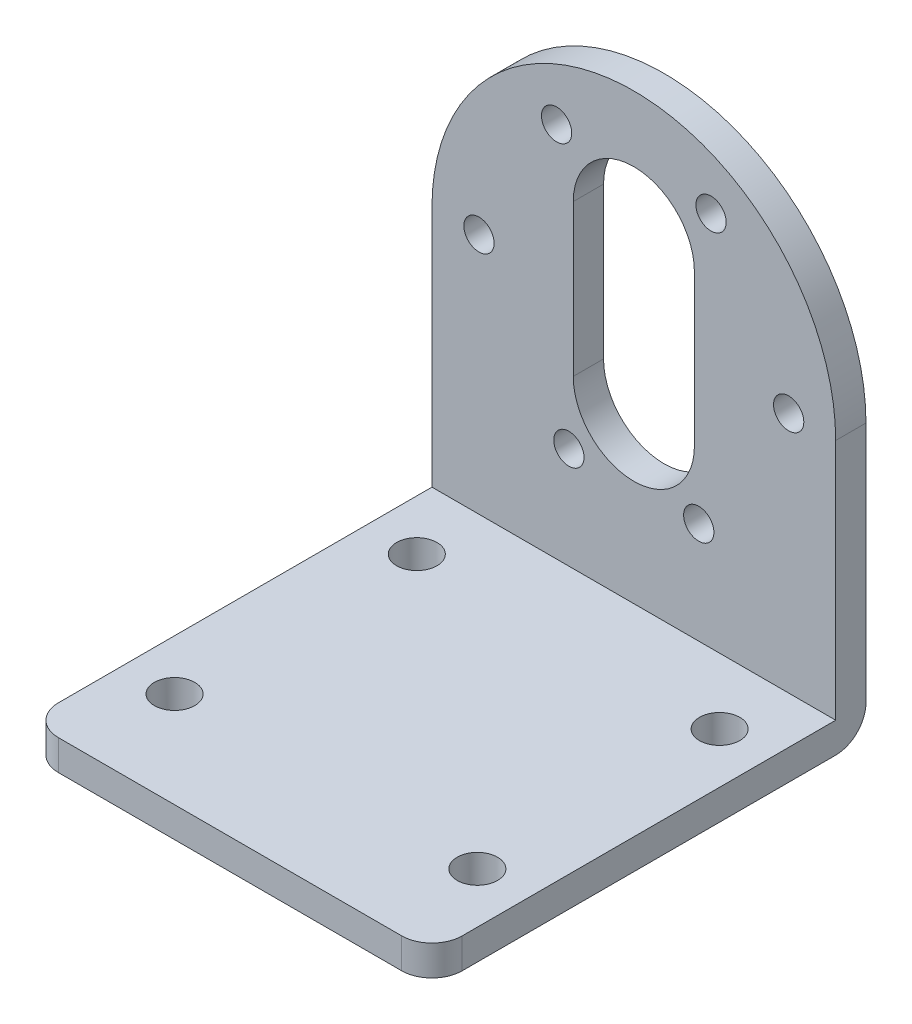
ISO-10303-21;
HEADER;
FILE_DESCRIPTION(('STEP AP214'),'2;1');
FILE_NAME('part.step','',(''),(''),'','','');
FILE_SCHEMA(('AUTOMOTIVE_DESIGN { 1 0 10303 214 1 1 1 1 }'));
ENDSEC;
DATA;
#1=APPLICATION_CONTEXT('core data for automotive mechanical design processes');
#2=APPLICATION_PROTOCOL_DEFINITION('international standard','automotive_design',2000,#1);
#3=PRODUCT_CONTEXT('',#1,'mechanical');
#4=PRODUCT('Part','Part','',(#3));
#5=PRODUCT_RELATED_PRODUCT_CATEGORY('part','',(#4));
#6=PRODUCT_DEFINITION_FORMATION('','',#4);
#7=PRODUCT_DEFINITION_CONTEXT('part definition',#1,'design');
#8=PRODUCT_DEFINITION('design','',#6,#7);
#9=PRODUCT_DEFINITION_SHAPE('','',#8);
#10=(LENGTH_UNIT() NAMED_UNIT(*) SI_UNIT(.MILLI.,.METRE.));
#11=(NAMED_UNIT(*) PLANE_ANGLE_UNIT() SI_UNIT($,.RADIAN.));
#12=(NAMED_UNIT(*) SI_UNIT($,.STERADIAN.) SOLID_ANGLE_UNIT());
#13=UNCERTAINTY_MEASURE_WITH_UNIT(LENGTH_MEASURE(1.E-05),#10,'distance_accuracy_value','');
#14=(GEOMETRIC_REPRESENTATION_CONTEXT(3) GLOBAL_UNCERTAINTY_ASSIGNED_CONTEXT((#13)) GLOBAL_UNIT_ASSIGNED_CONTEXT((#10,
#11,#12)) REPRESENTATION_CONTEXT('',''));
#15=CARTESIAN_POINT('',(0.,0.,0.));
#16=DIRECTION('',(0.,0.,1.));
#17=DIRECTION('',(1.,0.,0.));
#18=AXIS2_PLACEMENT_3D('',#15,#16,#17);
#19=CARTESIAN_POINT('',(-20.,3.,21.5));
#20=DIRECTION('',(1.,0.,0.));
#21=DIRECTION('',(0.,0.,-1.));
#22=AXIS2_PLACEMENT_3D('',#19,#20,#21);
#23=PLANE('',#22);
#24=DIRECTION('',(0.,0.,1.));
#25=VECTOR('',#24,1.);
#26=CARTESIAN_POINT('',(-20.,0.,21.5));
#27=LINE('',#26,#25);
#28=CARTESIAN_POINT('',(-20.,0.,-18.5));
#29=VERTEX_POINT('',#28);
#30=CARTESIAN_POINT('',(-20.,0.,18.5));
#31=VERTEX_POINT('',#30);
#32=EDGE_CURVE('E240',#29,#31,#27,.T.);
#33=ORIENTED_EDGE('',*,*,#32,.T.);
#34=DIRECTION('',(0.,-1.,0.));
#35=VECTOR('',#34,1.);
#36=CARTESIAN_POINT('',(-20.,3.,18.5));
#37=LINE('',#36,#35);
#38=CARTESIAN_POINT('',(-20.,3.,18.5));
#39=VERTEX_POINT('',#38);
#40=EDGE_CURVE('E11',#31,#39,#37,.F.);
#41=ORIENTED_EDGE('',*,*,#40,.T.);
#42=DIRECTION('',(0.,0.,1.));
#43=VECTOR('',#42,1.);
#44=CARTESIAN_POINT('',(-20.,3.,21.5));
#45=LINE('',#44,#43);
#46=CARTESIAN_POINT('',(-20.,3.,-18.5));
#47=VERTEX_POINT('',#46);
#48=EDGE_CURVE('E241',#47,#39,#45,.T.);
#49=ORIENTED_EDGE('',*,*,#48,.F.);
#50=DIRECTION('',(0.,-1.,0.));
#51=VECTOR('',#50,1.);
#52=CARTESIAN_POINT('',(-20.,27.,-18.5));
#53=LINE('',#52,#51);
#54=CARTESIAN_POINT('',(-20.,27.,-18.5));
#55=VERTEX_POINT('',#54);
#56=EDGE_CURVE('E237',#55,#47,#53,.T.);
#57=ORIENTED_EDGE('',*,*,#56,.F.);
#58=DIRECTION('',(0.,0.,1.));
#59=VECTOR('',#58,1.);
#60=CARTESIAN_POINT('',(-20.,27.,-21.5));
#61=LINE('',#60,#59);
#62=CARTESIAN_POINT('',(-20.,27.,-21.5));
#63=VERTEX_POINT('',#62);
#64=EDGE_CURVE('E226',#63,#55,#61,.T.);
#65=ORIENTED_EDGE('',*,*,#64,.F.);
#66=DIRECTION('',(0.,-1.,0.));
#67=VECTOR('',#66,1.);
#68=CARTESIAN_POINT('',(-20.,3.,-21.5));
#69=LINE('',#68,#67);
#70=CARTESIAN_POINT('',(-20.,3.,-21.5));
#71=VERTEX_POINT('',#70);
#72=EDGE_CURVE('E250',#63,#71,#69,.T.);
#73=ORIENTED_EDGE('',*,*,#72,.T.);
#74=CARTESIAN_POINT('',(-20.,3.,-18.5));
#75=DIRECTION('',(1.,0.,0.));
#76=DIRECTION('',(0.,0.,-1.));
#77=AXIS2_PLACEMENT_3D('',#74,#75,#76);
#78=CIRCLE('',#77,3.);
#79=EDGE_CURVE('E265',#71,#29,#78,.F.);
#80=ORIENTED_EDGE('',*,*,#79,.T.);
#81=EDGE_LOOP('',(#33,#41,#49,#57,#65,#73,#80));
#82=FACE_BOUND('',#81,.T.);
#83=ADVANCED_FACE('F36',(#82),#23,.F.);
#84=CARTESIAN_POINT('',(20.,3.,21.5));
#85=DIRECTION('',(0.,0.,-1.));
#86=DIRECTION('',(-1.,0.,0.));
#87=AXIS2_PLACEMENT_3D('',#84,#85,#86);
#88=PLANE('',#87);
#89=DIRECTION('',(1.,0.,0.));
#90=VECTOR('',#89,1.);
#91=CARTESIAN_POINT('',(20.,0.,21.5));
#92=LINE('',#91,#90);
#93=CARTESIAN_POINT('',(-17.,0.,21.5));
#94=VERTEX_POINT('',#93);
#95=CARTESIAN_POINT('',(17.,0.,21.5));
#96=VERTEX_POINT('',#95);
#97=EDGE_CURVE('E253',#94,#96,#92,.T.);
#98=ORIENTED_EDGE('',*,*,#97,.T.);
#99=DIRECTION('',(0.,-1.,0.));
#100=VECTOR('',#99,1.);
#101=CARTESIAN_POINT('',(17.,3.,21.5));
#102=LINE('',#101,#100);
#103=CARTESIAN_POINT('',(17.,3.,21.5));
#104=VERTEX_POINT('',#103);
#105=EDGE_CURVE('E290',#96,#104,#102,.F.);
#106=ORIENTED_EDGE('',*,*,#105,.T.);
#107=DIRECTION('',(1.,0.,0.));
#108=VECTOR('',#107,1.);
#109=CARTESIAN_POINT('',(20.,3.,21.5));
#110=LINE('',#109,#108);
#111=CARTESIAN_POINT('',(-17.,3.,21.5));
#112=VERTEX_POINT('',#111);
#113=EDGE_CURVE('E244',#112,#104,#110,.T.);
#114=ORIENTED_EDGE('',*,*,#113,.F.);
#115=DIRECTION('',(0.,-1.,0.));
#116=VECTOR('',#115,1.);
#117=CARTESIAN_POINT('',(-17.,3.,21.5));
#118=LINE('',#117,#116);
#119=EDGE_CURVE('E287',#112,#94,#118,.T.);
#120=ORIENTED_EDGE('',*,*,#119,.T.);
#121=EDGE_LOOP('',(#98,#106,#114,#120));
#122=FACE_BOUND('',#121,.T.);
#123=ADVANCED_FACE('F310',(#122),#88,.F.);
#124=CARTESIAN_POINT('',(20.,3.,21.5));
#125=DIRECTION('',(-1.,0.,0.));
#126=DIRECTION('',(0.,0.,1.));
#127=AXIS2_PLACEMENT_3D('',#124,#125,#126);
#128=PLANE('',#127);
#129=DIRECTION('',(0.,0.,-1.));
#130=VECTOR('',#129,1.);
#131=CARTESIAN_POINT('',(20.,3.,21.5));
#132=LINE('',#131,#130);
#133=CARTESIAN_POINT('',(20.,3.,18.5));
#134=VERTEX_POINT('',#133);
#135=CARTESIAN_POINT('',(20.,3.,-18.5));
#136=VERTEX_POINT('',#135);
#137=EDGE_CURVE('E248',#134,#136,#132,.T.);
#138=ORIENTED_EDGE('',*,*,#137,.F.);
#139=DIRECTION('',(0.,-1.,0.));
#140=VECTOR('',#139,1.);
#141=CARTESIAN_POINT('',(20.,3.,18.5));
#142=LINE('',#141,#140);
#143=CARTESIAN_POINT('',(20.,0.,18.5));
#144=VERTEX_POINT('',#143);
#145=EDGE_CURVE('E272',#134,#144,#142,.T.);
#146=ORIENTED_EDGE('',*,*,#145,.T.);
#147=DIRECTION('',(0.,0.,-1.));
#148=VECTOR('',#147,1.);
#149=CARTESIAN_POINT('',(20.,0.,21.5));
#150=LINE('',#149,#148);
#151=CARTESIAN_POINT('',(20.,0.,-18.5));
#152=VERTEX_POINT('',#151);
#153=EDGE_CURVE('E245',#144,#152,#150,.T.);
#154=ORIENTED_EDGE('',*,*,#153,.T.);
#155=CARTESIAN_POINT('',(20.,3.,-18.5));
#156=DIRECTION('',(-1.,0.,0.));
#157=DIRECTION('',(0.,0.,1.));
#158=AXIS2_PLACEMENT_3D('',#155,#156,#157);
#159=CIRCLE('',#158,3.);
#160=CARTESIAN_POINT('',(20.,3.,-21.5));
#161=VERTEX_POINT('',#160);
#162=EDGE_CURVE('E270',#152,#161,#159,.F.);
#163=ORIENTED_EDGE('',*,*,#162,.T.);
#164=DIRECTION('',(0.,-1.,0.));
#165=VECTOR('',#164,1.);
#166=CARTESIAN_POINT('',(20.,3.,-21.5));
#167=LINE('',#166,#165);
#168=CARTESIAN_POINT('',(20.,27.,-21.5));
#169=VERTEX_POINT('',#168);
#170=EDGE_CURVE('E259',#169,#161,#167,.T.);
#171=ORIENTED_EDGE('',*,*,#170,.F.);
#172=DIRECTION('',(0.,0.,-1.));
#173=VECTOR('',#172,1.);
#174=CARTESIAN_POINT('',(20.,27.,-21.5));
#175=LINE('',#174,#173);
#176=CARTESIAN_POINT('',(20.,27.,-18.5));
#177=VERTEX_POINT('',#176);
#178=EDGE_CURVE('E229',#177,#169,#175,.T.);
#179=ORIENTED_EDGE('',*,*,#178,.F.);
#180=DIRECTION('',(0.,-1.,0.));
#181=VECTOR('',#180,1.);
#182=CARTESIAN_POINT('',(20.,27.,-18.5));
#183=LINE('',#182,#181);
#184=EDGE_CURVE('E232',#177,#136,#183,.T.);
#185=ORIENTED_EDGE('',*,*,#184,.T.);
#186=EDGE_LOOP('',(#138,#146,#154,#163,#171,#179,#185));
#187=FACE_BOUND('',#186,.T.);
#188=ADVANCED_FACE('F302',(#187),#128,.F.);
#189=CARTESIAN_POINT('',(20.,3.,-21.5));
#190=DIRECTION('',(0.,0.,1.));
#191=DIRECTION('',(1.,0.,0.));
#192=AXIS2_PLACEMENT_3D('',#189,#190,#191);
#193=PLANE('',#192);
#194=DIRECTION('',(0.,1.,0.));
#195=VECTOR('',#194,1.);
#196=CARTESIAN_POINT('',(6.00000000000001,3.,-21.5));
#197=LINE('',#196,#195);
#198=CARTESIAN_POINT('',(6.,19.5,-21.5));
#199=VERTEX_POINT('',#198);
#200=CARTESIAN_POINT('',(6.,34.5,-21.5));
#201=VERTEX_POINT('',#200);
#202=EDGE_CURVE('E161',#199,#201,#197,.T.);
#203=ORIENTED_EDGE('',*,*,#202,.T.);
#204=CARTESIAN_POINT('',(0.,34.5,-21.5));
#205=DIRECTION('',(0.,0.,1.));
#206=DIRECTION('',(1.,0.,0.));
#207=AXIS2_PLACEMENT_3D('',#204,#205,#206);
#208=CIRCLE('',#207,6.);
#209=CARTESIAN_POINT('',(-6.,34.5,-21.5));
#210=VERTEX_POINT('',#209);
#211=EDGE_CURVE('E164',#201,#210,#208,.T.);
#212=ORIENTED_EDGE('',*,*,#211,.T.);
#213=DIRECTION('',(0.,-1.,0.));
#214=VECTOR('',#213,1.);
#215=CARTESIAN_POINT('',(-5.99999999999999,2.99999999999999,-21.5));
#216=LINE('',#215,#214);
#217=CARTESIAN_POINT('',(-6.,19.5,-21.5));
#218=VERTEX_POINT('',#217);
#219=EDGE_CURVE('E156',#210,#218,#216,.T.);
#220=ORIENTED_EDGE('',*,*,#219,.T.);
#221=CARTESIAN_POINT('',(0.,19.5,-21.5));
#222=DIRECTION('',(0.,0.,1.));
#223=DIRECTION('',(1.,0.,0.));
#224=AXIS2_PLACEMENT_3D('',#221,#222,#223);
#225=CIRCLE('',#224,6.);
#226=EDGE_CURVE('E136',#218,#199,#225,.T.);
#227=ORIENTED_EDGE('',*,*,#226,.T.);
#228=EDGE_LOOP('',(#203,#212,#220,#227));
#229=FACE_BOUND('',#228,.T.);
#230=CARTESIAN_POINT('',(-7.65,40.2963566438329,-21.5));
#231=DIRECTION('',(0.,0.,1.));
#232=DIRECTION('',(1.,0.,0.));
#233=AXIS2_PLACEMENT_3D('',#230,#231,#232);
#234=CIRCLE('',#233,1.5);
#235=CARTESIAN_POINT('',(-6.15,40.2963566438329,-21.5));
#236=VERTEX_POINT('',#235);
#237=EDGE_CURVE('E198',#236,#236,#234,.F.);
#238=ORIENTED_EDGE('',*,*,#237,.F.);
#239=EDGE_LOOP('',(#238));
#240=FACE_BOUND('',#239,.T.);
#241=CARTESIAN_POINT('',(-6.43290322580645,13.0740043053501,-21.5));
#242=DIRECTION('',(0.,0.,1.));
#243=DIRECTION('',(1.,0.,0.));
#244=AXIS2_PLACEMENT_3D('',#241,#242,#243);
#245=CIRCLE('',#244,1.5);
#246=CARTESIAN_POINT('',(-4.93290322580645,13.0740043053501,-21.5));
#247=VERTEX_POINT('',#246);
#248=EDGE_CURVE('E195',#247,#247,#245,.F.);
#249=ORIENTED_EDGE('',*,*,#248,.F.);
#250=EDGE_LOOP('',(#249));
#251=FACE_BOUND('',#250,.T.);
#252=CARTESIAN_POINT('',(-15.34,27.,-21.5));
#253=DIRECTION('',(0.,0.,1.));
#254=DIRECTION('',(1.,0.,0.));
#255=AXIS2_PLACEMENT_3D('',#252,#253,#254);
#256=CIRCLE('',#255,1.5);
#257=CARTESIAN_POINT('',(-13.84,27.,-21.5));
#258=VERTEX_POINT('',#257);
#259=EDGE_CURVE('E186',#258,#258,#256,.F.);
#260=ORIENTED_EDGE('',*,*,#259,.F.);
#261=EDGE_LOOP('',(#260));
#262=FACE_BOUND('',#261,.T.);
#263=CARTESIAN_POINT('',(7.65,40.2963566438329,-21.5));
#264=DIRECTION('',(0.,0.,1.));
#265=DIRECTION('',(1.,0.,0.));
#266=AXIS2_PLACEMENT_3D('',#263,#264,#265);
#267=CIRCLE('',#266,1.5);
#268=CARTESIAN_POINT('',(9.15,40.2963566438329,-21.5));
#269=VERTEX_POINT('',#268);
#270=EDGE_CURVE('E216',#269,#269,#267,.T.);
#271=ORIENTED_EDGE('',*,*,#270,.T.);
#272=EDGE_LOOP('',(#271));
#273=FACE_BOUND('',#272,.T.);
#274=CARTESIAN_POINT('',(6.43290322580645,13.0740043053501,-21.5));
#275=DIRECTION('',(0.,0.,1.));
#276=DIRECTION('',(1.,0.,0.));
#277=AXIS2_PLACEMENT_3D('',#274,#275,#276);
#278=CIRCLE('',#277,1.5);
#279=CARTESIAN_POINT('',(7.93290322580645,13.0740043053501,-21.5));
#280=VERTEX_POINT('',#279);
#281=EDGE_CURVE('E213',#280,#280,#278,.T.);
#282=ORIENTED_EDGE('',*,*,#281,.T.);
#283=EDGE_LOOP('',(#282));
#284=FACE_BOUND('',#283,.T.);
#285=CARTESIAN_POINT('',(15.34,27.,-21.5));
#286=DIRECTION('',(0.,0.,1.));
#287=DIRECTION('',(1.,0.,0.));
#288=AXIS2_PLACEMENT_3D('',#285,#286,#287);
#289=CIRCLE('',#288,1.5);
#290=CARTESIAN_POINT('',(16.84,27.,-21.5));
#291=VERTEX_POINT('',#290);
#292=EDGE_CURVE('E205',#291,#291,#289,.T.);
#293=ORIENTED_EDGE('',*,*,#292,.T.);
#294=EDGE_LOOP('',(#293));
#295=FACE_BOUND('',#294,.T.);
#296=ORIENTED_EDGE('',*,*,#170,.T.);
#297=DIRECTION('',(-1.,0.,0.));
#298=VECTOR('',#297,1.);
#299=CARTESIAN_POINT('',(20.,3.,-21.5));
#300=LINE('',#299,#298);
#301=EDGE_CURVE('E262',#161,#71,#300,.T.);
#302=ORIENTED_EDGE('',*,*,#301,.T.);
#303=ORIENTED_EDGE('',*,*,#72,.F.);
#304=CARTESIAN_POINT('',(0.,27.,-21.5));
#305=DIRECTION('',(0.,0.,1.));
#306=DIRECTION('',(1.,0.,0.));
#307=AXIS2_PLACEMENT_3D('',#304,#305,#306);
#308=CIRCLE('',#307,20.);
#309=EDGE_CURVE('E220',#169,#63,#308,.T.);
#310=ORIENTED_EDGE('',*,*,#309,.F.);
#311=EDGE_LOOP('',(#296,#302,#303,#310));
#312=FACE_BOUND('',#311,.T.);
#313=ADVANCED_FACE('F325',(#229,#240,#251,#262,#273,#284,#295,#312),#193,.F.);
#314=CARTESIAN_POINT('',(0.,3.,0.));
#315=DIRECTION('',(0.,1.,0.));
#316=DIRECTION('',(0.,0.,1.));
#317=AXIS2_PLACEMENT_3D('',#314,#315,#316);
#318=PLANE('',#317);
#319=CARTESIAN_POINT('',(-15.,3.,12.));
#320=DIRECTION('',(0.,-1.,0.));
#321=DIRECTION('',(0.,0.,-1.));
#322=AXIS2_PLACEMENT_3D('',#319,#320,#321);
#323=CIRCLE('',#322,2.);
#324=CARTESIAN_POINT('',(-15.,3.,10.));
#325=VERTEX_POINT('',#324);
#326=EDGE_CURVE('E167',#325,#325,#323,.T.);
#327=ORIENTED_EDGE('',*,*,#326,.T.);
#328=EDGE_LOOP('',(#327));
#329=FACE_BOUND('',#328,.T.);
#330=CARTESIAN_POINT('',(15.,3.,12.));
#331=DIRECTION('',(0.,1.,0.));
#332=DIRECTION('',(0.,0.,-1.));
#333=AXIS2_PLACEMENT_3D('',#330,#331,#332);
#334=CIRCLE('',#333,2.);
#335=CARTESIAN_POINT('',(15.,3.,10.));
#336=VERTEX_POINT('',#335);
#337=EDGE_CURVE('E171',#336,#336,#334,.T.);
#338=ORIENTED_EDGE('',*,*,#337,.F.);
#339=EDGE_LOOP('',(#338));
#340=FACE_BOUND('',#339,.T.);
#341=CARTESIAN_POINT('',(15.,3.,-12.));
#342=DIRECTION('',(0.,-1.,0.));
#343=DIRECTION('',(0.,0.,1.));
#344=AXIS2_PLACEMENT_3D('',#341,#342,#343);
#345=CIRCLE('',#344,2.);
#346=CARTESIAN_POINT('',(15.,3.,-10.));
#347=VERTEX_POINT('',#346);
#348=EDGE_CURVE('E175',#347,#347,#345,.T.);
#349=ORIENTED_EDGE('',*,*,#348,.T.);
#350=EDGE_LOOP('',(#349));
#351=FACE_BOUND('',#350,.T.);
#352=CARTESIAN_POINT('',(-15.,3.,-12.));
#353=DIRECTION('',(0.,1.,0.));
#354=DIRECTION('',(0.,0.,1.));
#355=AXIS2_PLACEMENT_3D('',#352,#353,#354);
#356=CIRCLE('',#355,2.);
#357=CARTESIAN_POINT('',(-15.,3.,-10.));
#358=VERTEX_POINT('',#357);
#359=EDGE_CURVE('E179',#358,#358,#356,.T.);
#360=ORIENTED_EDGE('',*,*,#359,.F.);
#361=EDGE_LOOP('',(#360));
#362=FACE_BOUND('',#361,.T.);
#363=ORIENTED_EDGE('',*,*,#113,.T.);
#364=CARTESIAN_POINT('',(17.,3.,18.5));
#365=DIRECTION('',(0.,1.,0.));
#366=DIRECTION('',(0.,0.,1.));
#367=AXIS2_PLACEMENT_3D('',#364,#365,#366);
#368=CIRCLE('',#367,3.);
#369=EDGE_CURVE('E44',#104,#134,#368,.T.);
#370=ORIENTED_EDGE('',*,*,#369,.T.);
#371=ORIENTED_EDGE('',*,*,#137,.T.);
#372=DIRECTION('',(1.,0.,0.));
#373=VECTOR('',#372,1.);
#374=CARTESIAN_POINT('',(-20.,3.,-18.5));
#375=LINE('',#374,#373);
#376=EDGE_CURVE('E223',#47,#136,#375,.T.);
#377=ORIENTED_EDGE('',*,*,#376,.F.);
#378=ORIENTED_EDGE('',*,*,#48,.T.);
#379=CARTESIAN_POINT('',(-17.,3.,18.5));
#380=DIRECTION('',(0.,1.,0.));
#381=DIRECTION('',(0.,0.,1.));
#382=AXIS2_PLACEMENT_3D('',#379,#380,#381);
#383=CIRCLE('',#382,3.);
#384=EDGE_CURVE('E292',#39,#112,#383,.T.);
#385=ORIENTED_EDGE('',*,*,#384,.T.);
#386=EDGE_LOOP('',(#363,#370,#371,#377,#378,#385));
#387=FACE_BOUND('',#386,.T.);
#388=ADVANCED_FACE('F296',(#329,#340,#351,#362,#387),#318,.T.);
#389=CARTESIAN_POINT('',(0.,0.,0.));
#390=DIRECTION('',(0.,1.,0.));
#391=DIRECTION('',(0.,0.,1.));
#392=AXIS2_PLACEMENT_3D('',#389,#390,#391);
#393=PLANE('',#392);
#394=CARTESIAN_POINT('',(-15.,0.,12.));
#395=DIRECTION('',(0.,1.,0.));
#396=DIRECTION('',(0.,0.,1.));
#397=AXIS2_PLACEMENT_3D('',#394,#395,#396);
#398=CIRCLE('',#397,2.);
#399=CARTESIAN_POINT('',(-15.,0.,14.));
#400=VERTEX_POINT('',#399);
#401=EDGE_CURVE('E170',#400,#400,#398,.F.);
#402=ORIENTED_EDGE('',*,*,#401,.F.);
#403=EDGE_LOOP('',(#402));
#404=FACE_BOUND('',#403,.T.);
#405=CARTESIAN_POINT('',(15.,0.,12.));
#406=DIRECTION('',(0.,1.,0.));
#407=DIRECTION('',(0.,0.,1.));
#408=AXIS2_PLACEMENT_3D('',#405,#406,#407);
#409=CIRCLE('',#408,2.);
#410=CARTESIAN_POINT('',(15.,0.,14.));
#411=VERTEX_POINT('',#410);
#412=EDGE_CURVE('E174',#411,#411,#409,.T.);
#413=ORIENTED_EDGE('',*,*,#412,.T.);
#414=EDGE_LOOP('',(#413));
#415=FACE_BOUND('',#414,.T.);
#416=CARTESIAN_POINT('',(15.,0.,-12.));
#417=DIRECTION('',(0.,1.,0.));
#418=DIRECTION('',(0.,0.,1.));
#419=AXIS2_PLACEMENT_3D('',#416,#417,#418);
#420=CIRCLE('',#419,2.);
#421=CARTESIAN_POINT('',(15.,0.,-10.));
#422=VERTEX_POINT('',#421);
#423=EDGE_CURVE('E178',#422,#422,#420,.F.);
#424=ORIENTED_EDGE('',*,*,#423,.F.);
#425=EDGE_LOOP('',(#424));
#426=FACE_BOUND('',#425,.T.);
#427=CARTESIAN_POINT('',(-15.,0.,-12.));
#428=DIRECTION('',(0.,1.,0.));
#429=DIRECTION('',(0.,0.,1.));
#430=AXIS2_PLACEMENT_3D('',#427,#428,#429);
#431=CIRCLE('',#430,2.);
#432=CARTESIAN_POINT('',(-15.,0.,-10.));
#433=VERTEX_POINT('',#432);
#434=EDGE_CURVE('E182',#433,#433,#431,.T.);
#435=ORIENTED_EDGE('',*,*,#434,.T.);
#436=EDGE_LOOP('',(#435));
#437=FACE_BOUND('',#436,.T.);
#438=ORIENTED_EDGE('',*,*,#153,.F.);
#439=CARTESIAN_POINT('',(17.,0.,18.5));
#440=DIRECTION('',(0.,1.,0.));
#441=DIRECTION('',(0.,0.,1.));
#442=AXIS2_PLACEMENT_3D('',#439,#440,#441);
#443=CIRCLE('',#442,3.);
#444=EDGE_CURVE('E285',#144,#96,#443,.F.);
#445=ORIENTED_EDGE('',*,*,#444,.T.);
#446=ORIENTED_EDGE('',*,*,#97,.F.);
#447=CARTESIAN_POINT('',(-17.,0.,18.5));
#448=DIRECTION('',(0.,1.,0.));
#449=DIRECTION('',(0.,0.,1.));
#450=AXIS2_PLACEMENT_3D('',#447,#448,#449);
#451=CIRCLE('',#450,3.);
#452=EDGE_CURVE('E283',#94,#31,#451,.F.);
#453=ORIENTED_EDGE('',*,*,#452,.T.);
#454=ORIENTED_EDGE('',*,*,#32,.F.);
#455=DIRECTION('',(-1.,0.,0.));
#456=VECTOR('',#455,1.);
#457=CARTESIAN_POINT('',(0.,0.,-18.5));
#458=LINE('',#457,#456);
#459=EDGE_CURVE('E267',#29,#152,#458,.F.);
#460=ORIENTED_EDGE('',*,*,#459,.T.);
#461=EDGE_LOOP('',(#438,#445,#446,#453,#454,#460));
#462=FACE_BOUND('',#461,.T.);
#463=ADVANCED_FACE('F308',(#404,#415,#426,#437,#462),#393,.F.);
#464=CARTESIAN_POINT('',(-20.,27.,-18.5));
#465=DIRECTION('',(0.,0.,-1.));
#466=DIRECTION('',(-1.,0.,0.));
#467=AXIS2_PLACEMENT_3D('',#464,#465,#466);
#468=PLANE('',#467);
#469=DIRECTION('',(0.,-1.,0.));
#470=VECTOR('',#469,1.);
#471=CARTESIAN_POINT('',(-6.,34.5,-18.5));
#472=LINE('',#471,#470);
#473=CARTESIAN_POINT('',(-6.,34.5,-18.5));
#474=VERTEX_POINT('',#473);
#475=CARTESIAN_POINT('',(-6.,19.5,-18.5));
#476=VERTEX_POINT('',#475);
#477=EDGE_CURVE('E142',#474,#476,#472,.T.);
#478=ORIENTED_EDGE('',*,*,#477,.F.);
#479=CARTESIAN_POINT('',(0.,34.5,-18.5));
#480=DIRECTION('',(0.,0.,1.));
#481=DIRECTION('',(1.,0.,0.));
#482=AXIS2_PLACEMENT_3D('',#479,#480,#481);
#483=CIRCLE('',#482,6.);
#484=CARTESIAN_POINT('',(6.,34.5,-18.5));
#485=VERTEX_POINT('',#484);
#486=EDGE_CURVE('E59',#485,#474,#483,.T.);
#487=ORIENTED_EDGE('',*,*,#486,.F.);
#488=DIRECTION('',(0.,1.,0.));
#489=VECTOR('',#488,1.);
#490=CARTESIAN_POINT('',(6.,34.5,-18.5));
#491=LINE('',#490,#489);
#492=CARTESIAN_POINT('',(6.,19.5,-18.5));
#493=VERTEX_POINT('',#492);
#494=EDGE_CURVE('E149',#493,#485,#491,.T.);
#495=ORIENTED_EDGE('',*,*,#494,.F.);
#496=CARTESIAN_POINT('',(0.,19.5,-18.5));
#497=DIRECTION('',(0.,0.,1.));
#498=DIRECTION('',(1.,0.,0.));
#499=AXIS2_PLACEMENT_3D('',#496,#497,#498);
#500=CIRCLE('',#499,6.);
#501=EDGE_CURVE('E133',#476,#493,#500,.T.);
#502=ORIENTED_EDGE('',*,*,#501,.F.);
#503=EDGE_LOOP('',(#478,#487,#495,#502));
#504=FACE_BOUND('',#503,.T.);
#505=CARTESIAN_POINT('',(-7.65,40.2963566438329,-18.5));
#506=DIRECTION('',(0.,0.,-1.));
#507=DIRECTION('',(-1.,0.,0.));
#508=AXIS2_PLACEMENT_3D('',#505,#506,#507);
#509=CIRCLE('',#508,1.5);
#510=CARTESIAN_POINT('',(-9.15,40.2963566438329,-18.5));
#511=VERTEX_POINT('',#510);
#512=EDGE_CURVE('E183',#511,#511,#509,.T.);
#513=ORIENTED_EDGE('',*,*,#512,.T.);
#514=EDGE_LOOP('',(#513));
#515=FACE_BOUND('',#514,.T.);
#516=CARTESIAN_POINT('',(-6.43290322580645,13.0740043053501,-18.5));
#517=DIRECTION('',(0.,0.,-1.));
#518=DIRECTION('',(-1.,0.,0.));
#519=AXIS2_PLACEMENT_3D('',#516,#517,#518);
#520=CIRCLE('',#519,1.5);
#521=CARTESIAN_POINT('',(-7.93290322580645,13.0740043053501,-18.5));
#522=VERTEX_POINT('',#521);
#523=EDGE_CURVE('E187',#522,#522,#520,.T.);
#524=ORIENTED_EDGE('',*,*,#523,.T.);
#525=EDGE_LOOP('',(#524));
#526=FACE_BOUND('',#525,.T.);
#527=CARTESIAN_POINT('',(-15.34,27.,-18.5));
#528=DIRECTION('',(0.,0.,-1.));
#529=DIRECTION('',(-1.,0.,0.));
#530=AXIS2_PLACEMENT_3D('',#527,#528,#529);
#531=CIRCLE('',#530,1.5);
#532=CARTESIAN_POINT('',(-16.84,27.,-18.5));
#533=VERTEX_POINT('',#532);
#534=EDGE_CURVE('E190',#533,#533,#531,.T.);
#535=ORIENTED_EDGE('',*,*,#534,.T.);
#536=EDGE_LOOP('',(#535));
#537=FACE_BOUND('',#536,.T.);
#538=CARTESIAN_POINT('',(7.65,40.2963566438329,-18.5));
#539=DIRECTION('',(0.,0.,1.));
#540=DIRECTION('',(1.,0.,0.));
#541=AXIS2_PLACEMENT_3D('',#538,#539,#540);
#542=CIRCLE('',#541,1.5);
#543=CARTESIAN_POINT('',(9.15,40.2963566438329,-18.5));
#544=VERTEX_POINT('',#543);
#545=EDGE_CURVE('E202',#544,#544,#542,.T.);
#546=ORIENTED_EDGE('',*,*,#545,.F.);
#547=EDGE_LOOP('',(#546));
#548=FACE_BOUND('',#547,.T.);
#549=CARTESIAN_POINT('',(6.43290322580645,13.0740043053501,-18.5));
#550=DIRECTION('',(0.,0.,1.));
#551=DIRECTION('',(1.,0.,0.));
#552=AXIS2_PLACEMENT_3D('',#549,#550,#551);
#553=CIRCLE('',#552,1.5);
#554=CARTESIAN_POINT('',(7.93290322580645,13.0740043053501,-18.5));
#555=VERTEX_POINT('',#554);
#556=EDGE_CURVE('E206',#555,#555,#553,.T.);
#557=ORIENTED_EDGE('',*,*,#556,.F.);
#558=EDGE_LOOP('',(#557));
#559=FACE_BOUND('',#558,.T.);
#560=CARTESIAN_POINT('',(15.34,27.,-18.5));
#561=DIRECTION('',(0.,0.,1.));
#562=DIRECTION('',(1.,0.,0.));
#563=AXIS2_PLACEMENT_3D('',#560,#561,#562);
#564=CIRCLE('',#563,1.5);
#565=CARTESIAN_POINT('',(16.84,27.,-18.5));
#566=VERTEX_POINT('',#565);
#567=EDGE_CURVE('E201',#566,#566,#564,.T.);
#568=ORIENTED_EDGE('',*,*,#567,.F.);
#569=EDGE_LOOP('',(#568));
#570=FACE_BOUND('',#569,.T.);
#571=ORIENTED_EDGE('',*,*,#184,.F.);
#572=CARTESIAN_POINT('',(0.,27.,-18.5));
#573=DIRECTION('',(0.,0.,1.));
#574=DIRECTION('',(1.,0.,0.));
#575=AXIS2_PLACEMENT_3D('',#572,#573,#574);
#576=CIRCLE('',#575,20.);
#577=EDGE_CURVE('E219',#177,#55,#576,.T.);
#578=ORIENTED_EDGE('',*,*,#577,.T.);
#579=ORIENTED_EDGE('',*,*,#56,.T.);
#580=ORIENTED_EDGE('',*,*,#376,.T.);
#581=EDGE_LOOP('',(#571,#578,#579,#580));
#582=FACE_BOUND('',#581,.T.);
#583=ADVANCED_FACE('F146',(#504,#515,#526,#537,#548,#559,#570,#582),#468,.F.);
#584=CARTESIAN_POINT('',(0.,27.,-21.5));
#585=DIRECTION('',(0.,0.,1.));
#586=DIRECTION('',(1.,0.,0.));
#587=AXIS2_PLACEMENT_3D('',#584,#585,#586);
#588=CYLINDRICAL_SURFACE('',#587,20.);
#589=ORIENTED_EDGE('',*,*,#309,.T.);
#590=ORIENTED_EDGE('',*,*,#64,.T.);
#591=ORIENTED_EDGE('',*,*,#577,.F.);
#592=ORIENTED_EDGE('',*,*,#178,.T.);
#593=EDGE_LOOP('',(#589,#590,#591,#592));
#594=FACE_BOUND('',#593,.T.);
#595=ADVANCED_FACE('F329',(#594),#588,.T.);
#596=CARTESIAN_POINT('',(15.34,27.,-26.5));
#597=DIRECTION('',(0.,0.,1.));
#598=DIRECTION('',(1.,0.,0.));
#599=AXIS2_PLACEMENT_3D('',#596,#597,#598);
#600=CYLINDRICAL_SURFACE('',#599,1.5);
#601=ORIENTED_EDGE('',*,*,#567,.T.);
#602=EDGE_LOOP('',(#601));
#603=FACE_BOUND('',#602,.T.);
#604=ORIENTED_EDGE('',*,*,#292,.F.);
#605=EDGE_LOOP('',(#604));
#606=FACE_BOUND('',#605,.T.);
#607=ADVANCED_FACE('F337',(#603,#606),#600,.F.);
#608=CARTESIAN_POINT('',(6.43290322580645,13.0740043053501,-26.5));
#609=DIRECTION('',(0.,0.,1.));
#610=DIRECTION('',(1.,0.,0.));
#611=AXIS2_PLACEMENT_3D('',#608,#609,#610);
#612=CYLINDRICAL_SURFACE('',#611,1.5);
#613=ORIENTED_EDGE('',*,*,#556,.T.);
#614=EDGE_LOOP('',(#613));
#615=FACE_BOUND('',#614,.T.);
#616=ORIENTED_EDGE('',*,*,#281,.F.);
#617=EDGE_LOOP('',(#616));
#618=FACE_BOUND('',#617,.T.);
#619=ADVANCED_FACE('F394',(#615,#618),#612,.F.);
#620=CARTESIAN_POINT('',(7.65,40.2963566438329,-26.5));
#621=DIRECTION('',(0.,0.,1.));
#622=DIRECTION('',(1.,0.,0.));
#623=AXIS2_PLACEMENT_3D('',#620,#621,#622);
#624=CYLINDRICAL_SURFACE('',#623,1.5);
#625=ORIENTED_EDGE('',*,*,#545,.T.);
#626=EDGE_LOOP('',(#625));
#627=FACE_BOUND('',#626,.T.);
#628=ORIENTED_EDGE('',*,*,#270,.F.);
#629=EDGE_LOOP('',(#628));
#630=FACE_BOUND('',#629,.T.);
#631=ADVANCED_FACE('F390',(#627,#630),#624,.F.);
#632=CARTESIAN_POINT('',(-15.34,27.,-26.5));
#633=DIRECTION('',(0.,0.,1.));
#634=DIRECTION('',(1.,0.,0.));
#635=AXIS2_PLACEMENT_3D('',#632,#633,#634);
#636=CYLINDRICAL_SURFACE('',#635,1.5);
#637=ORIENTED_EDGE('',*,*,#534,.F.);
#638=EDGE_LOOP('',(#637));
#639=FACE_BOUND('',#638,.T.);
#640=ORIENTED_EDGE('',*,*,#259,.T.);
#641=EDGE_LOOP('',(#640));
#642=FACE_BOUND('',#641,.T.);
#643=ADVANCED_FACE('F386',(#639,#642),#636,.F.);
#644=CARTESIAN_POINT('',(-6.43290322580645,13.0740043053501,-26.5));
#645=DIRECTION('',(0.,0.,1.));
#646=DIRECTION('',(1.,0.,0.));
#647=AXIS2_PLACEMENT_3D('',#644,#645,#646);
#648=CYLINDRICAL_SURFACE('',#647,1.5);
#649=ORIENTED_EDGE('',*,*,#523,.F.);
#650=EDGE_LOOP('',(#649));
#651=FACE_BOUND('',#650,.T.);
#652=ORIENTED_EDGE('',*,*,#248,.T.);
#653=EDGE_LOOP('',(#652));
#654=FACE_BOUND('',#653,.T.);
#655=ADVANCED_FACE('F382',(#651,#654),#648,.F.);
#656=CARTESIAN_POINT('',(-7.65,40.2963566438329,-26.5));
#657=DIRECTION('',(0.,0.,1.));
#658=DIRECTION('',(1.,0.,0.));
#659=AXIS2_PLACEMENT_3D('',#656,#657,#658);
#660=CYLINDRICAL_SURFACE('',#659,1.5);
#661=ORIENTED_EDGE('',*,*,#512,.F.);
#662=EDGE_LOOP('',(#661));
#663=FACE_BOUND('',#662,.T.);
#664=ORIENTED_EDGE('',*,*,#237,.T.);
#665=EDGE_LOOP('',(#664));
#666=FACE_BOUND('',#665,.T.);
#667=ADVANCED_FACE('F352',(#663,#666),#660,.F.);
#668=CARTESIAN_POINT('',(20.,3.,-18.5));
#669=DIRECTION('',(-1.,0.,0.));
#670=DIRECTION('',(0.,0.,1.));
#671=AXIS2_PLACEMENT_3D('',#668,#669,#670);
#672=CYLINDRICAL_SURFACE('',#671,3.);
#673=ORIENTED_EDGE('',*,*,#162,.F.);
#674=ORIENTED_EDGE('',*,*,#459,.F.);
#675=ORIENTED_EDGE('',*,*,#79,.F.);
#676=ORIENTED_EDGE('',*,*,#301,.F.);
#677=EDGE_LOOP('',(#673,#674,#675,#676));
#678=FACE_BOUND('',#677,.T.);
#679=ADVANCED_FACE('F323',(#678),#672,.T.);
#680=CARTESIAN_POINT('',(-15.,-5.,-12.));
#681=DIRECTION('',(0.,1.,0.));
#682=DIRECTION('',(0.,0.,1.));
#683=AXIS2_PLACEMENT_3D('',#680,#681,#682);
#684=CYLINDRICAL_SURFACE('',#683,2.);
#685=ORIENTED_EDGE('',*,*,#359,.T.);
#686=EDGE_LOOP('',(#685));
#687=FACE_BOUND('',#686,.T.);
#688=ORIENTED_EDGE('',*,*,#434,.F.);
#689=EDGE_LOOP('',(#688));
#690=FACE_BOUND('',#689,.T.);
#691=ADVANCED_FACE('F351',(#687,#690),#684,.F.);
#692=CARTESIAN_POINT('',(15.,-5.,-12.));
#693=DIRECTION('',(0.,1.,0.));
#694=DIRECTION('',(0.,0.,1.));
#695=AXIS2_PLACEMENT_3D('',#692,#693,#694);
#696=CYLINDRICAL_SURFACE('',#695,2.);
#697=ORIENTED_EDGE('',*,*,#348,.F.);
#698=EDGE_LOOP('',(#697));
#699=FACE_BOUND('',#698,.T.);
#700=ORIENTED_EDGE('',*,*,#423,.T.);
#701=EDGE_LOOP('',(#700));
#702=FACE_BOUND('',#701,.T.);
#703=ADVANCED_FACE('F366',(#699,#702),#696,.F.);
#704=CARTESIAN_POINT('',(15.,-5.,12.));
#705=DIRECTION('',(0.,1.,0.));
#706=DIRECTION('',(0.,0.,1.));
#707=AXIS2_PLACEMENT_3D('',#704,#705,#706);
#708=CYLINDRICAL_SURFACE('',#707,2.);
#709=ORIENTED_EDGE('',*,*,#337,.T.);
#710=EDGE_LOOP('',(#709));
#711=FACE_BOUND('',#710,.T.);
#712=ORIENTED_EDGE('',*,*,#412,.F.);
#713=EDGE_LOOP('',(#712));
#714=FACE_BOUND('',#713,.T.);
#715=ADVANCED_FACE('F360',(#711,#714),#708,.F.);
#716=CARTESIAN_POINT('',(-15.,-5.,12.));
#717=DIRECTION('',(0.,1.,0.));
#718=DIRECTION('',(0.,0.,1.));
#719=AXIS2_PLACEMENT_3D('',#716,#717,#718);
#720=CYLINDRICAL_SURFACE('',#719,2.);
#721=ORIENTED_EDGE('',*,*,#326,.F.);
#722=EDGE_LOOP('',(#721));
#723=FACE_BOUND('',#722,.T.);
#724=ORIENTED_EDGE('',*,*,#401,.T.);
#725=EDGE_LOOP('',(#724));
#726=FACE_BOUND('',#725,.T.);
#727=ADVANCED_FACE('F354',(#723,#726),#720,.F.);
#728=CARTESIAN_POINT('',(17.,3.,18.5));
#729=DIRECTION('',(0.,-1.,0.));
#730=DIRECTION('',(0.,0.,-1.));
#731=AXIS2_PLACEMENT_3D('',#728,#729,#730);
#732=CYLINDRICAL_SURFACE('',#731,3.);
#733=ORIENTED_EDGE('',*,*,#369,.F.);
#734=ORIENTED_EDGE('',*,*,#105,.F.);
#735=ORIENTED_EDGE('',*,*,#444,.F.);
#736=ORIENTED_EDGE('',*,*,#145,.F.);
#737=EDGE_LOOP('',(#733,#734,#735,#736));
#738=FACE_BOUND('',#737,.T.);
#739=ADVANCED_FACE('F305',(#738),#732,.T.);
#740=CARTESIAN_POINT('',(-17.,3.,18.5));
#741=DIRECTION('',(0.,-1.,0.));
#742=DIRECTION('',(0.,0.,-1.));
#743=AXIS2_PLACEMENT_3D('',#740,#741,#742);
#744=CYLINDRICAL_SURFACE('',#743,3.);
#745=ORIENTED_EDGE('',*,*,#384,.F.);
#746=ORIENTED_EDGE('',*,*,#40,.F.);
#747=ORIENTED_EDGE('',*,*,#452,.F.);
#748=ORIENTED_EDGE('',*,*,#119,.F.);
#749=EDGE_LOOP('',(#745,#746,#747,#748));
#750=FACE_BOUND('',#749,.T.);
#751=ADVANCED_FACE('F38',(#750),#744,.T.);
#752=CARTESIAN_POINT('',(0.,34.5,-26.5));
#753=DIRECTION('',(0.,0.,1.));
#754=DIRECTION('',(1.,0.,0.));
#755=AXIS2_PLACEMENT_3D('',#752,#753,#754);
#756=CYLINDRICAL_SURFACE('',#755,6.);
#757=DIRECTION('',(0.,0.,1.));
#758=VECTOR('',#757,1.);
#759=CARTESIAN_POINT('',(6.,34.5,-26.5));
#760=LINE('',#759,#758);
#761=EDGE_CURVE('E154',#201,#485,#760,.T.);
#762=ORIENTED_EDGE('',*,*,#761,.T.);
#763=ORIENTED_EDGE('',*,*,#486,.T.);
#764=DIRECTION('',(0.,0.,1.));
#765=VECTOR('',#764,1.);
#766=CARTESIAN_POINT('',(-6.,34.5,-26.5));
#767=LINE('',#766,#765);
#768=EDGE_CURVE('E139',#210,#474,#767,.T.);
#769=ORIENTED_EDGE('',*,*,#768,.F.);
#770=ORIENTED_EDGE('',*,*,#211,.F.);
#771=EDGE_LOOP('',(#762,#763,#769,#770));
#772=FACE_BOUND('',#771,.T.);
#773=ADVANCED_FACE('F359',(#772),#756,.F.);
#774=CARTESIAN_POINT('',(6.,34.5,-26.5));
#775=DIRECTION('',(1.,0.,0.));
#776=DIRECTION('',(0.,1.,0.));
#777=AXIS2_PLACEMENT_3D('',#774,#775,#776);
#778=PLANE('',#777);
#779=DIRECTION('',(0.,0.,1.));
#780=VECTOR('',#779,1.);
#781=CARTESIAN_POINT('',(6.,19.5,-26.5));
#782=LINE('',#781,#780);
#783=EDGE_CURVE('E138',#199,#493,#782,.T.);
#784=ORIENTED_EDGE('',*,*,#783,.T.);
#785=ORIENTED_EDGE('',*,*,#494,.T.);
#786=ORIENTED_EDGE('',*,*,#761,.F.);
#787=ORIENTED_EDGE('',*,*,#202,.F.);
#788=EDGE_LOOP('',(#784,#785,#786,#787));
#789=FACE_BOUND('',#788,.T.);
#790=ADVANCED_FACE('F432',(#789),#778,.F.);
#791=CARTESIAN_POINT('',(0.,19.5,-26.5));
#792=DIRECTION('',(0.,0.,1.));
#793=DIRECTION('',(1.,0.,0.));
#794=AXIS2_PLACEMENT_3D('',#791,#792,#793);
#795=CYLINDRICAL_SURFACE('',#794,6.);
#796=DIRECTION('',(0.,0.,1.));
#797=VECTOR('',#796,1.);
#798=CARTESIAN_POINT('',(-6.,19.5,-26.5));
#799=LINE('',#798,#797);
#800=EDGE_CURVE('E51',#218,#476,#799,.T.);
#801=ORIENTED_EDGE('',*,*,#800,.T.);
#802=ORIENTED_EDGE('',*,*,#501,.T.);
#803=ORIENTED_EDGE('',*,*,#783,.F.);
#804=ORIENTED_EDGE('',*,*,#226,.F.);
#805=EDGE_LOOP('',(#801,#802,#803,#804));
#806=FACE_BOUND('',#805,.T.);
#807=ADVANCED_FACE('F130',(#806),#795,.F.);
#808=CARTESIAN_POINT('',(-6.,34.5,-26.5));
#809=DIRECTION('',(-1.,0.,0.));
#810=DIRECTION('',(0.,-1.,0.));
#811=AXIS2_PLACEMENT_3D('',#808,#809,#810);
#812=PLANE('',#811);
#813=ORIENTED_EDGE('',*,*,#768,.T.);
#814=ORIENTED_EDGE('',*,*,#477,.T.);
#815=ORIENTED_EDGE('',*,*,#800,.F.);
#816=ORIENTED_EDGE('',*,*,#219,.F.);
#817=EDGE_LOOP('',(#813,#814,#815,#816));
#818=FACE_BOUND('',#817,.T.);
#819=ADVANCED_FACE('F143',(#818),#812,.F.);
#820=CLOSED_SHELL('',(#83,#123,#188,#313,#388,#463,#583,#595,#607,#619,#631,#643,#655,#667,#679,
#691,#703,#715,#727,#739,#751,#773,#790,#807,#819));
#821=MANIFOLD_SOLID_BREP('B2',#820);
#822=ADVANCED_BREP_SHAPE_REPRESENTATION('',(#18,#821),#14);
#823=SHAPE_DEFINITION_REPRESENTATION(#9,#822);
ENDSEC;
END-ISO-10303-21;
